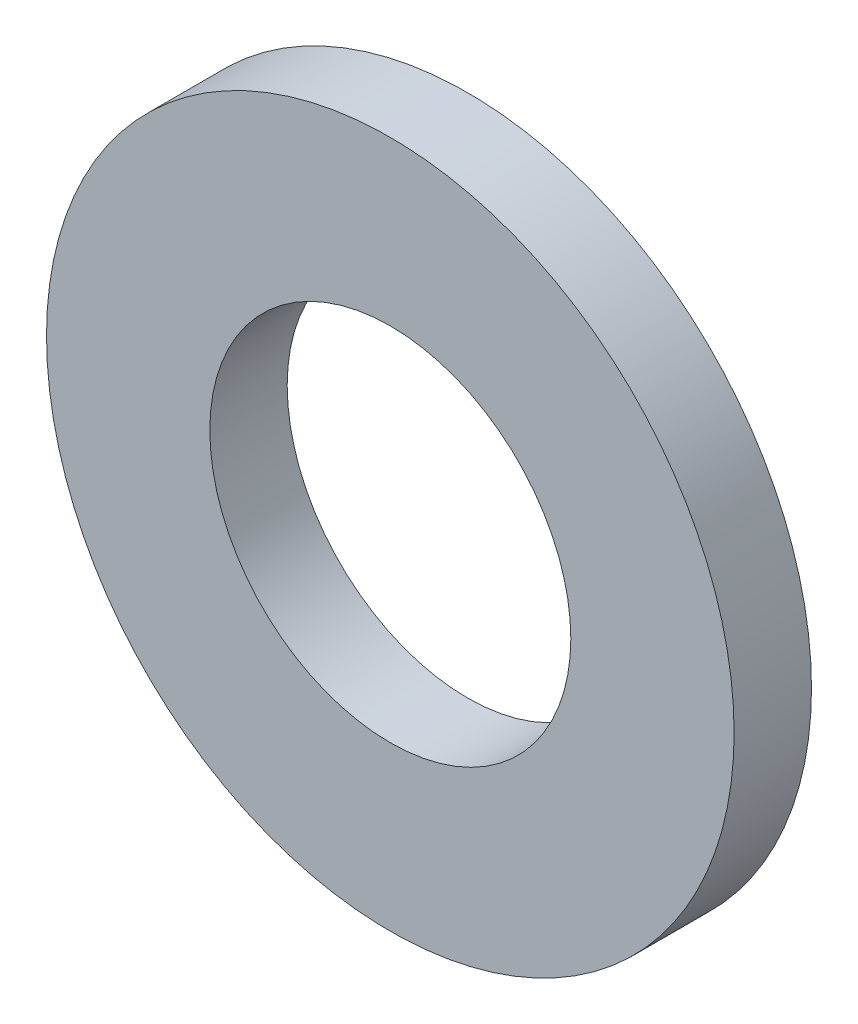
ISO-10303-21;
HEADER;
FILE_DESCRIPTION(('STEP AP214'),'2;1');
FILE_NAME('part.step','',(''),(''),'','','');
FILE_SCHEMA(('AUTOMOTIVE_DESIGN { 1 0 10303 214 1 1 1 1 }'));
ENDSEC;
DATA;
#1=APPLICATION_CONTEXT('core data for automotive mechanical design processes');
#2=APPLICATION_PROTOCOL_DEFINITION('international standard','automotive_design',2000,#1);
#3=PRODUCT_CONTEXT('',#1,'mechanical');
#4=PRODUCT('Part','Part','',(#3));
#5=PRODUCT_RELATED_PRODUCT_CATEGORY('part','',(#4));
#6=PRODUCT_DEFINITION_FORMATION('','',#4);
#7=PRODUCT_DEFINITION_CONTEXT('part definition',#1,'design');
#8=PRODUCT_DEFINITION('design','',#6,#7);
#9=PRODUCT_DEFINITION_SHAPE('','',#8);
#10=(LENGTH_UNIT() NAMED_UNIT(*) SI_UNIT(.MILLI.,.METRE.));
#11=(NAMED_UNIT(*) PLANE_ANGLE_UNIT() SI_UNIT($,.RADIAN.));
#12=(NAMED_UNIT(*) SI_UNIT($,.STERADIAN.) SOLID_ANGLE_UNIT());
#13=UNCERTAINTY_MEASURE_WITH_UNIT(LENGTH_MEASURE(1.E-05),#10,'distance_accuracy_value','');
#14=(GEOMETRIC_REPRESENTATION_CONTEXT(3) GLOBAL_UNCERTAINTY_ASSIGNED_CONTEXT((#13)) GLOBAL_UNIT_ASSIGNED_CONTEXT((#10,
#11,#12)) REPRESENTATION_CONTEXT('',''));
#15=CARTESIAN_POINT('',(0.,0.,0.));
#16=DIRECTION('',(0.,0.,1.));
#17=DIRECTION('',(1.,0.,0.));
#18=AXIS2_PLACEMENT_3D('',#15,#16,#17);
#19=CARTESIAN_POINT('',(0.,0.,1.8));
#20=DIRECTION('',(0.,0.,1.));
#21=DIRECTION('',(1.,0.,0.));
#22=AXIS2_PLACEMENT_3D('',#19,#20,#21);
#23=PLANE('',#22);
#24=CARTESIAN_POINT('',(0.,0.,1.8));
#25=DIRECTION('',(0.,0.,1.));
#26=DIRECTION('',(1.,0.,0.));
#27=AXIS2_PLACEMENT_3D('',#24,#25,#26);
#28=CIRCLE('',#27,8.);
#29=CARTESIAN_POINT('',(8.,0.,1.8));
#30=VERTEX_POINT('',#29);
#31=EDGE_CURVE('E10',#30,#30,#28,.T.);
#32=ORIENTED_EDGE('',*,*,#31,.T.);
#33=EDGE_LOOP('',(#32));
#34=FACE_BOUND('',#33,.T.);
#35=CARTESIAN_POINT('',(0.,0.,1.8));
#36=DIRECTION('',(0.,0.,1.));
#37=DIRECTION('',(1.,0.,0.));
#38=AXIS2_PLACEMENT_3D('',#35,#36,#37);
#39=CIRCLE('',#38,4.2);
#40=CARTESIAN_POINT('',(4.2,0.,1.8));
#41=VERTEX_POINT('',#40);
#42=EDGE_CURVE('E48',#41,#41,#39,.T.);
#43=ORIENTED_EDGE('',*,*,#42,.F.);
#44=EDGE_LOOP('',(#43));
#45=FACE_BOUND('',#44,.T.);
#46=ADVANCED_FACE('F36',(#34,#45),#23,.T.);
#47=CARTESIAN_POINT('',(0.,0.,0.));
#48=DIRECTION('',(0.,0.,1.));
#49=DIRECTION('',(1.,0.,0.));
#50=AXIS2_PLACEMENT_3D('',#47,#48,#49);
#51=PLANE('',#50);
#52=CARTESIAN_POINT('',(0.,0.,0.));
#53=DIRECTION('',(0.,0.,1.));
#54=DIRECTION('',(1.,0.,0.));
#55=AXIS2_PLACEMENT_3D('',#52,#53,#54);
#56=CIRCLE('',#55,8.);
#57=CARTESIAN_POINT('',(8.,0.,0.));
#58=VERTEX_POINT('',#57);
#59=EDGE_CURVE('E40',#58,#58,#56,.T.);
#60=ORIENTED_EDGE('',*,*,#59,.F.);
#61=EDGE_LOOP('',(#60));
#62=FACE_BOUND('',#61,.T.);
#63=CARTESIAN_POINT('',(0.,0.,0.));
#64=DIRECTION('',(0.,0.,1.));
#65=DIRECTION('',(1.,0.,0.));
#66=AXIS2_PLACEMENT_3D('',#63,#64,#65);
#67=CIRCLE('',#66,4.2);
#68=CARTESIAN_POINT('',(4.2,0.,0.));
#69=VERTEX_POINT('',#68);
#70=EDGE_CURVE('E50',#69,#69,#67,.T.);
#71=ORIENTED_EDGE('',*,*,#70,.T.);
#72=EDGE_LOOP('',(#71));
#73=FACE_BOUND('',#72,.T.);
#74=ADVANCED_FACE('F60',(#62,#73),#51,.F.);
#75=CARTESIAN_POINT('',(0.,0.,1.8));
#76=DIRECTION('',(0.,0.,-1.));
#77=DIRECTION('',(-1.,0.,0.));
#78=AXIS2_PLACEMENT_3D('',#75,#76,#77);
#79=CYLINDRICAL_SURFACE('',#78,8.);
#80=ORIENTED_EDGE('',*,*,#31,.F.);
#81=EDGE_LOOP('',(#80));
#82=FACE_BOUND('',#81,.T.);
#83=ORIENTED_EDGE('',*,*,#59,.T.);
#84=EDGE_LOOP('',(#83));
#85=FACE_BOUND('',#84,.T.);
#86=ADVANCED_FACE('F38',(#82,#85),#79,.T.);
#87=CARTESIAN_POINT('',(0.,0.,1.8));
#88=DIRECTION('',(0.,0.,-1.));
#89=DIRECTION('',(-1.,0.,0.));
#90=AXIS2_PLACEMENT_3D('',#87,#88,#89);
#91=CYLINDRICAL_SURFACE('',#90,4.2);
#92=ORIENTED_EDGE('',*,*,#42,.T.);
#93=EDGE_LOOP('',(#92));
#94=FACE_BOUND('',#93,.T.);
#95=ORIENTED_EDGE('',*,*,#70,.F.);
#96=EDGE_LOOP('',(#95));
#97=FACE_BOUND('',#96,.T.);
#98=ADVANCED_FACE('F56',(#94,#97),#91,.F.);
#99=CLOSED_SHELL('',(#46,#74,#86,#98));
#100=MANIFOLD_SOLID_BREP('B2',#99);
#101=ADVANCED_BREP_SHAPE_REPRESENTATION('',(#18,#100),#14);
#102=SHAPE_DEFINITION_REPRESENTATION(#9,#101);
ENDSEC;
END-ISO-10303-21;
